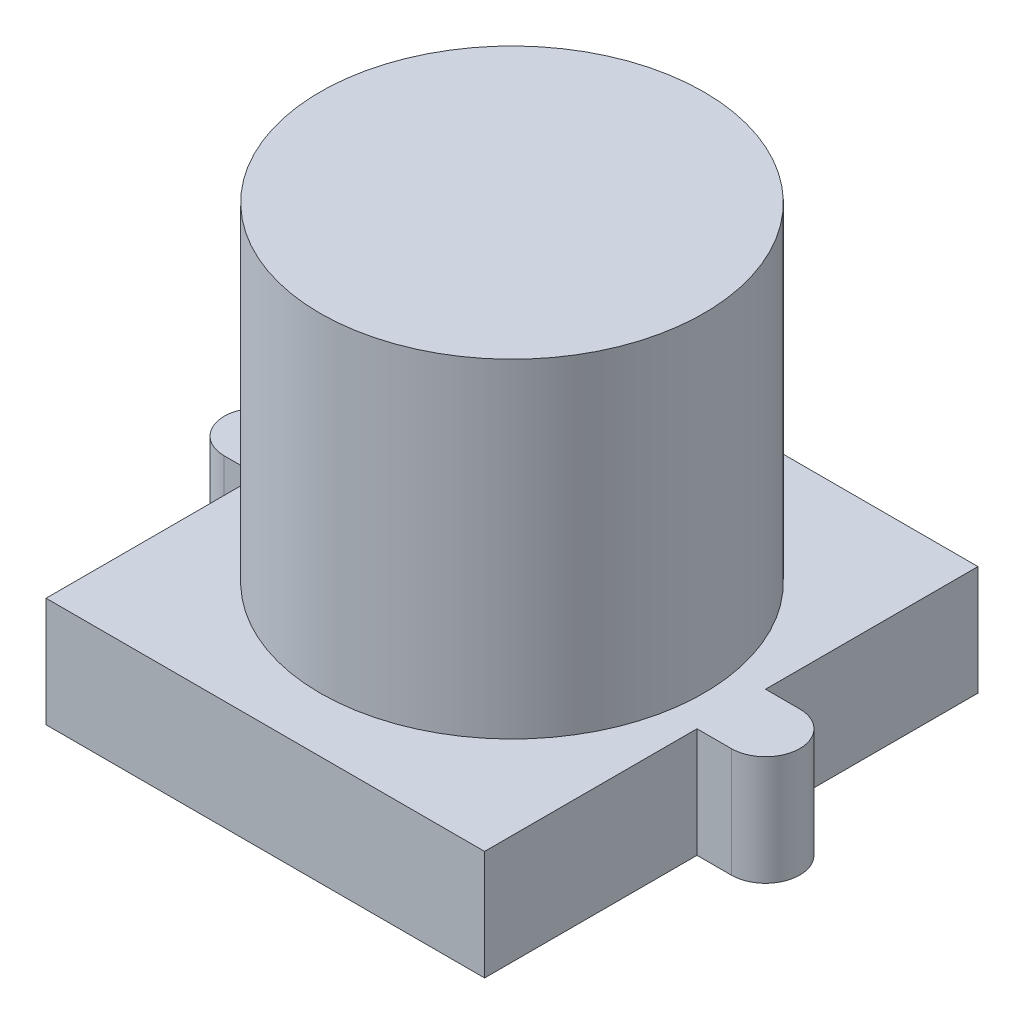
ISO-10303-21;
HEADER;
FILE_DESCRIPTION(('STEP AP214'),'2;1');
FILE_NAME('part.step','',(''),(''),'','','');
FILE_SCHEMA(('AUTOMOTIVE_DESIGN { 1 0 10303 214 1 1 1 1 }'));
ENDSEC;
DATA;
#1=APPLICATION_CONTEXT('core data for automotive mechanical design processes');
#2=APPLICATION_PROTOCOL_DEFINITION('international standard','automotive_design',2000,#1);
#3=PRODUCT_CONTEXT('',#1,'mechanical');
#4=PRODUCT('Part','Part','',(#3));
#5=PRODUCT_RELATED_PRODUCT_CATEGORY('part','',(#4));
#6=PRODUCT_DEFINITION_FORMATION('','',#4);
#7=PRODUCT_DEFINITION_CONTEXT('part definition',#1,'design');
#8=PRODUCT_DEFINITION('design','',#6,#7);
#9=PRODUCT_DEFINITION_SHAPE('','',#8);
#10=(LENGTH_UNIT() NAMED_UNIT(*) SI_UNIT(.MILLI.,.METRE.));
#11=(NAMED_UNIT(*) PLANE_ANGLE_UNIT() SI_UNIT($,.RADIAN.));
#12=(NAMED_UNIT(*) SI_UNIT($,.STERADIAN.) SOLID_ANGLE_UNIT());
#13=UNCERTAINTY_MEASURE_WITH_UNIT(LENGTH_MEASURE(1.E-05),#10,'distance_accuracy_value','');
#14=(GEOMETRIC_REPRESENTATION_CONTEXT(3) GLOBAL_UNCERTAINTY_ASSIGNED_CONTEXT((#13)) GLOBAL_UNIT_ASSIGNED_CONTEXT((#10,
#11,#12)) REPRESENTATION_CONTEXT('',''));
#15=CARTESIAN_POINT('',(0.,0.,0.));
#16=DIRECTION('',(0.,0.,1.));
#17=DIRECTION('',(1.,0.,0.));
#18=AXIS2_PLACEMENT_3D('',#15,#16,#17);
#19=CARTESIAN_POINT('',(0.,4.,0.));
#20=DIRECTION('',(1.,0.,0.));
#21=DIRECTION('',(0.,0.,-1.));
#22=AXIS2_PLACEMENT_3D('',#19,#20,#21);
#23=PLANE('',#22);
#24=DIRECTION('',(0.,0.,1.));
#25=VECTOR('',#24,1.);
#26=CARTESIAN_POINT('',(0.,0.,0.));
#27=LINE('',#26,#25);
#28=CARTESIAN_POINT('',(0.,0.,-7.75));
#29=VERTEX_POINT('',#28);
#30=CARTESIAN_POINT('',(0.,0.,0.));
#31=VERTEX_POINT('',#30);
#32=EDGE_CURVE('E160',#29,#31,#27,.T.);
#33=ORIENTED_EDGE('',*,*,#32,.T.);
#34=DIRECTION('',(0.,-1.,0.));
#35=VECTOR('',#34,1.);
#36=CARTESIAN_POINT('',(0.,4.,0.));
#37=LINE('',#36,#35);
#38=CARTESIAN_POINT('',(0.,4.,0.));
#39=VERTEX_POINT('',#38);
#40=EDGE_CURVE('E41',#39,#31,#37,.T.);
#41=ORIENTED_EDGE('',*,*,#40,.F.);
#42=DIRECTION('',(0.,0.,1.));
#43=VECTOR('',#42,1.);
#44=CARTESIAN_POINT('',(0.,4.,0.));
#45=LINE('',#44,#43);
#46=CARTESIAN_POINT('',(0.,4.,-7.75));
#47=VERTEX_POINT('',#46);
#48=EDGE_CURVE('E183',#47,#39,#45,.T.);
#49=ORIENTED_EDGE('',*,*,#48,.F.);
#50=DIRECTION('',(0.,-1.,0.));
#51=VECTOR('',#50,1.);
#52=CARTESIAN_POINT('',(0.,4.,-7.75));
#53=LINE('',#52,#51);
#54=EDGE_CURVE('E156',#47,#29,#53,.T.);
#55=ORIENTED_EDGE('',*,*,#54,.T.);
#56=EDGE_LOOP('',(#33,#41,#49,#55));
#57=FACE_BOUND('',#56,.T.);
#58=ADVANCED_FACE('F38',(#57),#23,.F.);
#59=CARTESIAN_POINT('',(0.,4.,0.));
#60=DIRECTION('',(0.,0.,-1.));
#61=DIRECTION('',(-1.,0.,0.));
#62=AXIS2_PLACEMENT_3D('',#59,#60,#61);
#63=PLANE('',#62);
#64=DIRECTION('',(1.,0.,0.));
#65=VECTOR('',#64,1.);
#66=CARTESIAN_POINT('',(0.,0.,0.));
#67=LINE('',#66,#65);
#68=CARTESIAN_POINT('',(16.,0.,0.));
#69=VERTEX_POINT('',#68);
#70=EDGE_CURVE('E163',#31,#69,#67,.T.);
#71=ORIENTED_EDGE('',*,*,#70,.T.);
#72=DIRECTION('',(0.,-1.,0.));
#73=VECTOR('',#72,1.);
#74=CARTESIAN_POINT('',(16.,4.,0.));
#75=LINE('',#74,#73);
#76=CARTESIAN_POINT('',(16.,4.,0.));
#77=VERTEX_POINT('',#76);
#78=EDGE_CURVE('E204',#77,#69,#75,.T.);
#79=ORIENTED_EDGE('',*,*,#78,.F.);
#80=DIRECTION('',(1.,0.,0.));
#81=VECTOR('',#80,1.);
#82=CARTESIAN_POINT('',(0.,4.,0.));
#83=LINE('',#82,#81);
#84=EDGE_CURVE('E111',#39,#77,#83,.T.);
#85=ORIENTED_EDGE('',*,*,#84,.F.);
#86=ORIENTED_EDGE('',*,*,#40,.T.);
#87=EDGE_LOOP('',(#71,#79,#85,#86));
#88=FACE_BOUND('',#87,.T.);
#89=ADVANCED_FACE('F210',(#88),#63,.F.);
#90=CARTESIAN_POINT('',(16.,4.,0.));
#91=DIRECTION('',(-1.,0.,0.));
#92=DIRECTION('',(0.,0.,1.));
#93=AXIS2_PLACEMENT_3D('',#90,#91,#92);
#94=PLANE('',#93);
#95=DIRECTION('',(0.,0.,-1.));
#96=VECTOR('',#95,1.);
#97=CARTESIAN_POINT('',(16.,0.,0.));
#98=LINE('',#97,#96);
#99=CARTESIAN_POINT('',(16.,0.,-7.75));
#100=VERTEX_POINT('',#99);
#101=EDGE_CURVE('E166',#69,#100,#98,.T.);
#102=ORIENTED_EDGE('',*,*,#101,.T.);
#103=DIRECTION('',(0.,-1.,0.));
#104=VECTOR('',#103,1.);
#105=CARTESIAN_POINT('',(16.,4.,-7.75));
#106=LINE('',#105,#104);
#107=CARTESIAN_POINT('',(16.,4.,-7.75));
#108=VERTEX_POINT('',#107);
#109=EDGE_CURVE('E202',#108,#100,#106,.T.);
#110=ORIENTED_EDGE('',*,*,#109,.F.);
#111=DIRECTION('',(0.,0.,-1.));
#112=VECTOR('',#111,1.);
#113=CARTESIAN_POINT('',(16.,4.,0.));
#114=LINE('',#113,#112);
#115=EDGE_CURVE('E227',#77,#108,#114,.T.);
#116=ORIENTED_EDGE('',*,*,#115,.F.);
#117=ORIENTED_EDGE('',*,*,#78,.T.);
#118=EDGE_LOOP('',(#102,#110,#116,#117));
#119=FACE_BOUND('',#118,.T.);
#120=ADVANCED_FACE('F219',(#119),#94,.F.);
#121=CARTESIAN_POINT('',(16.,4.,-7.75));
#122=DIRECTION('',(0.,0.,-1.));
#123=DIRECTION('',(-1.,0.,0.));
#124=AXIS2_PLACEMENT_3D('',#121,#122,#123);
#125=PLANE('',#124);
#126=DIRECTION('',(1.,0.,0.));
#127=VECTOR('',#126,1.);
#128=CARTESIAN_POINT('',(16.,0.,-7.75));
#129=LINE('',#128,#127);
#130=CARTESIAN_POINT('',(17.25,0.,-7.75));
#131=VERTEX_POINT('',#130);
#132=EDGE_CURVE('E168',#100,#131,#129,.T.);
#133=ORIENTED_EDGE('',*,*,#132,.T.);
#134=DIRECTION('',(0.,-1.,0.));
#135=VECTOR('',#134,1.);
#136=CARTESIAN_POINT('',(17.25,4.,-7.75));
#137=LINE('',#136,#135);
#138=CARTESIAN_POINT('',(17.25,4.,-7.75));
#139=VERTEX_POINT('',#138);
#140=EDGE_CURVE('E199',#139,#131,#137,.T.);
#141=ORIENTED_EDGE('',*,*,#140,.F.);
#142=DIRECTION('',(1.,0.,0.));
#143=VECTOR('',#142,1.);
#144=CARTESIAN_POINT('',(16.,4.,-7.75));
#145=LINE('',#144,#143);
#146=EDGE_CURVE('E224',#108,#139,#145,.T.);
#147=ORIENTED_EDGE('',*,*,#146,.F.);
#148=ORIENTED_EDGE('',*,*,#109,.T.);
#149=EDGE_LOOP('',(#133,#141,#147,#148));
#150=FACE_BOUND('',#149,.T.);
#151=ADVANCED_FACE('F222',(#150),#125,.F.);
#152=CARTESIAN_POINT('',(17.25,4.,-9.));
#153=DIRECTION('',(0.,-1.,0.));
#154=DIRECTION('',(0.,0.,-1.));
#155=AXIS2_PLACEMENT_3D('',#152,#153,#154);
#156=CYLINDRICAL_SURFACE('',#155,1.25);
#157=CARTESIAN_POINT('',(17.25,0.,-9.));
#158=DIRECTION('',(0.,1.,0.));
#159=DIRECTION('',(0.,0.,1.));
#160=AXIS2_PLACEMENT_3D('',#157,#158,#159);
#161=CIRCLE('',#160,1.25);
#162=CARTESIAN_POINT('',(17.25,0.,-10.25));
#163=VERTEX_POINT('',#162);
#164=EDGE_CURVE('E170',#131,#163,#161,.T.);
#165=ORIENTED_EDGE('',*,*,#164,.T.);
#166=DIRECTION('',(0.,-1.,0.));
#167=VECTOR('',#166,1.);
#168=CARTESIAN_POINT('',(17.25,4.,-10.25));
#169=LINE('',#168,#167);
#170=CARTESIAN_POINT('',(17.25,4.,-10.25));
#171=VERTEX_POINT('',#170);
#172=EDGE_CURVE('E196',#171,#163,#169,.T.);
#173=ORIENTED_EDGE('',*,*,#172,.F.);
#174=CARTESIAN_POINT('',(17.25,4.,-9.));
#175=DIRECTION('',(0.,1.,0.));
#176=DIRECTION('',(0.,0.,1.));
#177=AXIS2_PLACEMENT_3D('',#174,#175,#176);
#178=CIRCLE('',#177,1.25);
#179=EDGE_CURVE('E226',#139,#171,#178,.T.);
#180=ORIENTED_EDGE('',*,*,#179,.F.);
#181=ORIENTED_EDGE('',*,*,#140,.T.);
#182=EDGE_LOOP('',(#165,#173,#180,#181));
#183=FACE_BOUND('',#182,.T.);
#184=ADVANCED_FACE('F258',(#183),#156,.T.);
#185=CARTESIAN_POINT('',(17.25,4.,-10.25));
#186=DIRECTION('',(0.,0.,1.));
#187=DIRECTION('',(1.,0.,0.));
#188=AXIS2_PLACEMENT_3D('',#185,#186,#187);
#189=PLANE('',#188);
#190=DIRECTION('',(-1.,0.,0.));
#191=VECTOR('',#190,1.);
#192=CARTESIAN_POINT('',(17.25,0.,-10.25));
#193=LINE('',#192,#191);
#194=CARTESIAN_POINT('',(16.,0.,-10.25));
#195=VERTEX_POINT('',#194);
#196=EDGE_CURVE('E172',#163,#195,#193,.T.);
#197=ORIENTED_EDGE('',*,*,#196,.T.);
#198=DIRECTION('',(0.,-1.,0.));
#199=VECTOR('',#198,1.);
#200=CARTESIAN_POINT('',(16.,4.,-10.25));
#201=LINE('',#200,#199);
#202=CARTESIAN_POINT('',(16.,4.,-10.25));
#203=VERTEX_POINT('',#202);
#204=EDGE_CURVE('E193',#203,#195,#201,.T.);
#205=ORIENTED_EDGE('',*,*,#204,.F.);
#206=DIRECTION('',(-1.,0.,0.));
#207=VECTOR('',#206,1.);
#208=CARTESIAN_POINT('',(17.25,4.,-10.25));
#209=LINE('',#208,#207);
#210=EDGE_CURVE('E229',#171,#203,#209,.T.);
#211=ORIENTED_EDGE('',*,*,#210,.F.);
#212=ORIENTED_EDGE('',*,*,#172,.T.);
#213=EDGE_LOOP('',(#197,#205,#211,#212));
#214=FACE_BOUND('',#213,.T.);
#215=ADVANCED_FACE('F255',(#214),#189,.F.);
#216=CARTESIAN_POINT('',(16.,4.,-10.25));
#217=DIRECTION('',(-1.,0.,0.));
#218=DIRECTION('',(0.,0.,1.));
#219=AXIS2_PLACEMENT_3D('',#216,#217,#218);
#220=PLANE('',#219);
#221=DIRECTION('',(0.,0.,-1.));
#222=VECTOR('',#221,1.);
#223=CARTESIAN_POINT('',(16.,0.,-10.25));
#224=LINE('',#223,#222);
#225=CARTESIAN_POINT('',(16.,0.,-18.));
#226=VERTEX_POINT('',#225);
#227=EDGE_CURVE('E174',#195,#226,#224,.T.);
#228=ORIENTED_EDGE('',*,*,#227,.T.);
#229=DIRECTION('',(0.,-1.,0.));
#230=VECTOR('',#229,1.);
#231=CARTESIAN_POINT('',(16.,4.,-18.));
#232=LINE('',#231,#230);
#233=CARTESIAN_POINT('',(16.,4.,-18.));
#234=VERTEX_POINT('',#233);
#235=EDGE_CURVE('E190',#234,#226,#232,.T.);
#236=ORIENTED_EDGE('',*,*,#235,.F.);
#237=DIRECTION('',(0.,0.,-1.));
#238=VECTOR('',#237,1.);
#239=CARTESIAN_POINT('',(16.,4.,-10.25));
#240=LINE('',#239,#238);
#241=EDGE_CURVE('E235',#203,#234,#240,.T.);
#242=ORIENTED_EDGE('',*,*,#241,.F.);
#243=ORIENTED_EDGE('',*,*,#204,.T.);
#244=EDGE_LOOP('',(#228,#236,#242,#243));
#245=FACE_BOUND('',#244,.T.);
#246=ADVANCED_FACE('F251',(#245),#220,.F.);
#247=CARTESIAN_POINT('',(0.,4.,-18.));
#248=DIRECTION('',(0.,0.,1.));
#249=DIRECTION('',(1.,0.,0.));
#250=AXIS2_PLACEMENT_3D('',#247,#248,#249);
#251=PLANE('',#250);
#252=DIRECTION('',(-1.,0.,0.));
#253=VECTOR('',#252,1.);
#254=CARTESIAN_POINT('',(0.,0.,-18.));
#255=LINE('',#254,#253);
#256=CARTESIAN_POINT('',(0.,0.,-18.));
#257=VERTEX_POINT('',#256);
#258=EDGE_CURVE('E176',#226,#257,#255,.T.);
#259=ORIENTED_EDGE('',*,*,#258,.T.);
#260=DIRECTION('',(0.,-1.,0.));
#261=VECTOR('',#260,1.);
#262=CARTESIAN_POINT('',(0.,4.,-18.));
#263=LINE('',#262,#261);
#264=CARTESIAN_POINT('',(0.,4.,-18.));
#265=VERTEX_POINT('',#264);
#266=EDGE_CURVE('E187',#265,#257,#263,.T.);
#267=ORIENTED_EDGE('',*,*,#266,.F.);
#268=DIRECTION('',(-1.,0.,0.));
#269=VECTOR('',#268,1.);
#270=CARTESIAN_POINT('',(0.,4.,-18.));
#271=LINE('',#270,#269);
#272=EDGE_CURVE('E237',#234,#265,#271,.T.);
#273=ORIENTED_EDGE('',*,*,#272,.F.);
#274=ORIENTED_EDGE('',*,*,#235,.T.);
#275=EDGE_LOOP('',(#259,#267,#273,#274));
#276=FACE_BOUND('',#275,.T.);
#277=ADVANCED_FACE('F243',(#276),#251,.F.);
#278=CARTESIAN_POINT('',(0.,4.,-10.25));
#279=DIRECTION('',(1.,0.,0.));
#280=DIRECTION('',(0.,0.,-1.));
#281=AXIS2_PLACEMENT_3D('',#278,#279,#280);
#282=PLANE('',#281);
#283=DIRECTION('',(0.,0.,1.));
#284=VECTOR('',#283,1.);
#285=CARTESIAN_POINT('',(0.,0.,-10.25));
#286=LINE('',#285,#284);
#287=CARTESIAN_POINT('',(0.,0.,-10.25));
#288=VERTEX_POINT('',#287);
#289=EDGE_CURVE('E178',#257,#288,#286,.T.);
#290=ORIENTED_EDGE('',*,*,#289,.T.);
#291=DIRECTION('',(0.,-1.,0.));
#292=VECTOR('',#291,1.);
#293=CARTESIAN_POINT('',(0.,4.,-10.25));
#294=LINE('',#293,#292);
#295=CARTESIAN_POINT('',(0.,4.,-10.25));
#296=VERTEX_POINT('',#295);
#297=EDGE_CURVE('E151',#296,#288,#294,.T.);
#298=ORIENTED_EDGE('',*,*,#297,.F.);
#299=DIRECTION('',(0.,0.,1.));
#300=VECTOR('',#299,1.);
#301=CARTESIAN_POINT('',(0.,4.,-10.25));
#302=LINE('',#301,#300);
#303=EDGE_CURVE('E142',#265,#296,#302,.T.);
#304=ORIENTED_EDGE('',*,*,#303,.F.);
#305=ORIENTED_EDGE('',*,*,#266,.T.);
#306=EDGE_LOOP('',(#290,#298,#304,#305));
#307=FACE_BOUND('',#306,.T.);
#308=ADVANCED_FACE('F247',(#307),#282,.F.);
#309=CARTESIAN_POINT('',(-1.25,4.,-10.25));
#310=DIRECTION('',(0.,0.,1.));
#311=DIRECTION('',(1.,0.,0.));
#312=AXIS2_PLACEMENT_3D('',#309,#310,#311);
#313=PLANE('',#312);
#314=DIRECTION('',(-1.,0.,0.));
#315=VECTOR('',#314,1.);
#316=CARTESIAN_POINT('',(-1.25,0.,-10.25));
#317=LINE('',#316,#315);
#318=CARTESIAN_POINT('',(-1.25,0.,-10.25));
#319=VERTEX_POINT('',#318);
#320=EDGE_CURVE('E150',#288,#319,#317,.T.);
#321=ORIENTED_EDGE('',*,*,#320,.T.);
#322=DIRECTION('',(0.,-1.,0.));
#323=VECTOR('',#322,1.);
#324=CARTESIAN_POINT('',(-1.25,4.,-10.25));
#325=LINE('',#324,#323);
#326=CARTESIAN_POINT('',(-1.25,4.,-10.25));
#327=VERTEX_POINT('',#326);
#328=EDGE_CURVE('E147',#327,#319,#325,.T.);
#329=ORIENTED_EDGE('',*,*,#328,.F.);
#330=DIRECTION('',(-1.,0.,0.));
#331=VECTOR('',#330,1.);
#332=CARTESIAN_POINT('',(-1.25,4.,-10.25));
#333=LINE('',#332,#331);
#334=EDGE_CURVE('E136',#296,#327,#333,.T.);
#335=ORIENTED_EDGE('',*,*,#334,.F.);
#336=ORIENTED_EDGE('',*,*,#297,.T.);
#337=EDGE_LOOP('',(#321,#329,#335,#336));
#338=FACE_BOUND('',#337,.T.);
#339=ADVANCED_FACE('F148',(#338),#313,.F.);
#340=CARTESIAN_POINT('',(-1.25,4.,-9.));
#341=DIRECTION('',(0.,-1.,0.));
#342=DIRECTION('',(0.,0.,-1.));
#343=AXIS2_PLACEMENT_3D('',#340,#341,#342);
#344=CYLINDRICAL_SURFACE('',#343,1.25);
#345=CARTESIAN_POINT('',(-1.25,0.,-9.));
#346=DIRECTION('',(0.,1.,0.));
#347=DIRECTION('',(0.,0.,1.));
#348=AXIS2_PLACEMENT_3D('',#345,#346,#347);
#349=CIRCLE('',#348,1.25);
#350=CARTESIAN_POINT('',(-1.25,0.,-7.75));
#351=VERTEX_POINT('',#350);
#352=EDGE_CURVE('E96',#319,#351,#349,.T.);
#353=ORIENTED_EDGE('',*,*,#352,.T.);
#354=DIRECTION('',(0.,-1.,0.));
#355=VECTOR('',#354,1.);
#356=CARTESIAN_POINT('',(-1.25,4.,-7.75));
#357=LINE('',#356,#355);
#358=CARTESIAN_POINT('',(-1.25,4.,-7.75));
#359=VERTEX_POINT('',#358);
#360=EDGE_CURVE('E152',#359,#351,#357,.T.);
#361=ORIENTED_EDGE('',*,*,#360,.F.);
#362=CARTESIAN_POINT('',(-1.25,4.,-9.));
#363=DIRECTION('',(0.,1.,0.));
#364=DIRECTION('',(0.,0.,1.));
#365=AXIS2_PLACEMENT_3D('',#362,#363,#364);
#366=CIRCLE('',#365,1.25);
#367=EDGE_CURVE('E140',#327,#359,#366,.T.);
#368=ORIENTED_EDGE('',*,*,#367,.F.);
#369=ORIENTED_EDGE('',*,*,#328,.T.);
#370=EDGE_LOOP('',(#353,#361,#368,#369));
#371=FACE_BOUND('',#370,.T.);
#372=ADVANCED_FACE('F154',(#371),#344,.T.);
#373=CARTESIAN_POINT('',(-1.25,4.,-7.75));
#374=DIRECTION('',(0.,0.,-1.));
#375=DIRECTION('',(-1.,0.,0.));
#376=AXIS2_PLACEMENT_3D('',#373,#374,#375);
#377=PLANE('',#376);
#378=DIRECTION('',(1.,0.,0.));
#379=VECTOR('',#378,1.);
#380=CARTESIAN_POINT('',(-1.25,0.,-7.75));
#381=LINE('',#380,#379);
#382=EDGE_CURVE('E102',#351,#29,#381,.T.);
#383=ORIENTED_EDGE('',*,*,#382,.T.);
#384=ORIENTED_EDGE('',*,*,#54,.F.);
#385=DIRECTION('',(1.,0.,0.));
#386=VECTOR('',#385,1.);
#387=CARTESIAN_POINT('',(-1.25,4.,-7.75));
#388=LINE('',#387,#386);
#389=EDGE_CURVE('E55',#359,#47,#388,.T.);
#390=ORIENTED_EDGE('',*,*,#389,.F.);
#391=ORIENTED_EDGE('',*,*,#360,.T.);
#392=EDGE_LOOP('',(#383,#384,#390,#391));
#393=FACE_BOUND('',#392,.T.);
#394=ADVANCED_FACE('F339',(#393),#377,.F.);
#395=CARTESIAN_POINT('',(-1.25,4.,-9.));
#396=DIRECTION('',(0.,1.,0.));
#397=DIRECTION('',(0.,0.,1.));
#398=AXIS2_PLACEMENT_3D('',#395,#396,#397);
#399=PLANE('',#398);
#400=CARTESIAN_POINT('',(8.,4.,-9.));
#401=DIRECTION('',(0.,1.,0.));
#402=DIRECTION('',(0.,0.,1.));
#403=AXIS2_PLACEMENT_3D('',#400,#401,#402);
#404=CIRCLE('',#403,7.);
#405=CARTESIAN_POINT('',(8.,4.,-2.));
#406=VERTEX_POINT('',#405);
#407=EDGE_CURVE('E11',#406,#406,#404,.T.);
#408=ORIENTED_EDGE('',*,*,#407,.F.);
#409=EDGE_LOOP('',(#408));
#410=FACE_BOUND('',#409,.T.);
#411=ORIENTED_EDGE('',*,*,#48,.T.);
#412=ORIENTED_EDGE('',*,*,#84,.T.);
#413=ORIENTED_EDGE('',*,*,#115,.T.);
#414=ORIENTED_EDGE('',*,*,#146,.T.);
#415=ORIENTED_EDGE('',*,*,#179,.T.);
#416=ORIENTED_EDGE('',*,*,#210,.T.);
#417=ORIENTED_EDGE('',*,*,#241,.T.);
#418=ORIENTED_EDGE('',*,*,#272,.T.);
#419=ORIENTED_EDGE('',*,*,#303,.T.);
#420=ORIENTED_EDGE('',*,*,#334,.T.);
#421=ORIENTED_EDGE('',*,*,#367,.T.);
#422=ORIENTED_EDGE('',*,*,#389,.T.);
#423=EDGE_LOOP('',(#411,#412,#413,#414,#415,#416,#417,#418,#419,#420,#421,#422));
#424=FACE_BOUND('',#423,.T.);
#425=ADVANCED_FACE('F138',(#410,#424),#399,.T.);
#426=CARTESIAN_POINT('',(-1.25,0.,-9.));
#427=DIRECTION('',(0.,1.,0.));
#428=DIRECTION('',(0.,0.,1.));
#429=AXIS2_PLACEMENT_3D('',#426,#427,#428);
#430=PLANE('',#429);
#431=ORIENTED_EDGE('',*,*,#32,.F.);
#432=ORIENTED_EDGE('',*,*,#382,.F.);
#433=ORIENTED_EDGE('',*,*,#352,.F.);
#434=ORIENTED_EDGE('',*,*,#320,.F.);
#435=ORIENTED_EDGE('',*,*,#289,.F.);
#436=ORIENTED_EDGE('',*,*,#258,.F.);
#437=ORIENTED_EDGE('',*,*,#227,.F.);
#438=ORIENTED_EDGE('',*,*,#196,.F.);
#439=ORIENTED_EDGE('',*,*,#164,.F.);
#440=ORIENTED_EDGE('',*,*,#132,.F.);
#441=ORIENTED_EDGE('',*,*,#101,.F.);
#442=ORIENTED_EDGE('',*,*,#70,.F.);
#443=EDGE_LOOP('',(#431,#432,#433,#434,#435,#436,#437,#438,#439,#440,#441,#442));
#444=FACE_BOUND('',#443,.T.);
#445=ADVANCED_FACE('F215',(#444),#430,.F.);
#446=CARTESIAN_POINT('',(8.,16.,-9.));
#447=DIRECTION('',(0.,-1.,0.));
#448=DIRECTION('',(0.,0.,-1.));
#449=AXIS2_PLACEMENT_3D('',#446,#447,#448);
#450=CYLINDRICAL_SURFACE('',#449,7.);
#451=CARTESIAN_POINT('',(8.,16.,-9.));
#452=DIRECTION('',(0.,1.,0.));
#453=DIRECTION('',(0.,0.,1.));
#454=AXIS2_PLACEMENT_3D('',#451,#452,#453);
#455=CIRCLE('',#454,7.);
#456=CARTESIAN_POINT('',(8.,16.,-2.));
#457=VERTEX_POINT('',#456);
#458=EDGE_CURVE('E164',#457,#457,#455,.T.);
#459=ORIENTED_EDGE('',*,*,#458,.F.);
#460=EDGE_LOOP('',(#459));
#461=FACE_BOUND('',#460,.T.);
#462=ORIENTED_EDGE('',*,*,#407,.T.);
#463=EDGE_LOOP('',(#462));
#464=FACE_BOUND('',#463,.T.);
#465=ADVANCED_FACE('F360',(#461,#464),#450,.T.);
#466=CARTESIAN_POINT('',(8.,16.,-9.));
#467=DIRECTION('',(0.,1.,0.));
#468=DIRECTION('',(0.,0.,1.));
#469=AXIS2_PLACEMENT_3D('',#466,#467,#468);
#470=PLANE('',#469);
#471=ORIENTED_EDGE('',*,*,#458,.T.);
#472=EDGE_LOOP('',(#471));
#473=FACE_BOUND('',#472,.T.);
#474=ADVANCED_FACE('F378',(#473),#470,.T.);
#475=CLOSED_SHELL('',(#58,#89,#120,#151,#184,#215,#246,#277,#308,#339,#372,#394,#425,#445,#465,#474));
#476=MANIFOLD_SOLID_BREP('B2',#475);
#477=ADVANCED_BREP_SHAPE_REPRESENTATION('',(#18,#476),#14);
#478=SHAPE_DEFINITION_REPRESENTATION(#9,#477);
ENDSEC;
END-ISO-10303-21;
